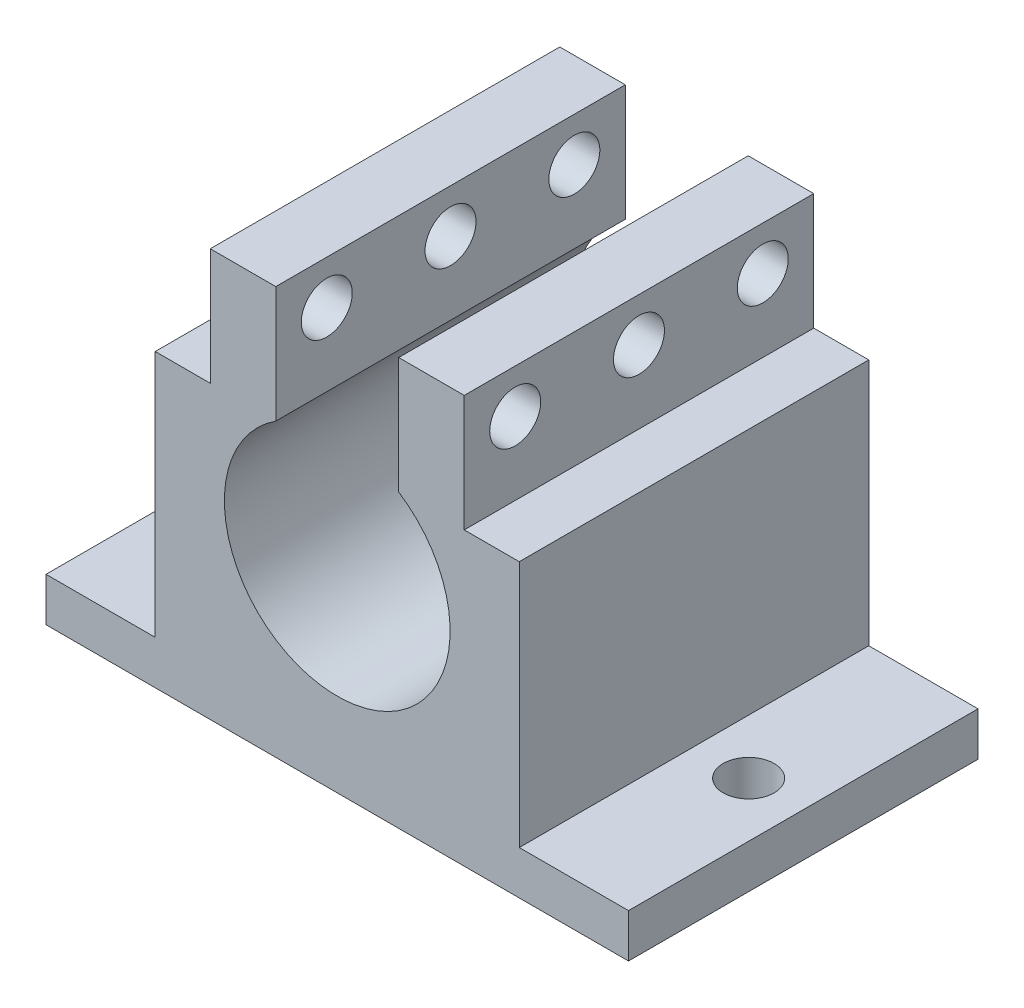
ISO-10303-21;
HEADER;
FILE_DESCRIPTION(('STEP AP214'),'2;1');
FILE_NAME('part.step','',(''),(''),'','','');
FILE_SCHEMA(('AUTOMOTIVE_DESIGN { 1 0 10303 214 1 1 1 1 }'));
ENDSEC;
DATA;
#1=APPLICATION_CONTEXT('core data for automotive mechanical design processes');
#2=APPLICATION_PROTOCOL_DEFINITION('international standard','automotive_design',2000,#1);
#3=PRODUCT_CONTEXT('',#1,'mechanical');
#4=PRODUCT('Part','Part','',(#3));
#5=PRODUCT_RELATED_PRODUCT_CATEGORY('part','',(#4));
#6=PRODUCT_DEFINITION_FORMATION('','',#4);
#7=PRODUCT_DEFINITION_CONTEXT('part definition',#1,'design');
#8=PRODUCT_DEFINITION('design','',#6,#7);
#9=PRODUCT_DEFINITION_SHAPE('','',#8);
#10=(LENGTH_UNIT() NAMED_UNIT(*) SI_UNIT(.MILLI.,.METRE.));
#11=(NAMED_UNIT(*) PLANE_ANGLE_UNIT() SI_UNIT($,.RADIAN.));
#12=(NAMED_UNIT(*) SI_UNIT($,.STERADIAN.) SOLID_ANGLE_UNIT());
#13=UNCERTAINTY_MEASURE_WITH_UNIT(LENGTH_MEASURE(1.E-05),#10,'distance_accuracy_value','');
#14=(GEOMETRIC_REPRESENTATION_CONTEXT(3) GLOBAL_UNCERTAINTY_ASSIGNED_CONTEXT((#13)) GLOBAL_UNIT_ASSIGNED_CONTEXT((#10,
#11,#12)) REPRESENTATION_CONTEXT('',''));
#15=CARTESIAN_POINT('',(0.,0.,0.));
#16=DIRECTION('',(0.,0.,1.));
#17=DIRECTION('',(1.,0.,0.));
#18=AXIS2_PLACEMENT_3D('',#15,#16,#17);
#19=CARTESIAN_POINT('',(-12.5,-10.,24.));
#20=DIRECTION('',(1.,0.,0.));
#21=DIRECTION('',(0.,0.,-1.));
#22=AXIS2_PLACEMENT_3D('',#19,#20,#21);
#23=PLANE('',#22);
#24=DIRECTION('',(0.,0.,-1.));
#25=VECTOR('',#24,1.);
#26=CARTESIAN_POINT('',(-12.5,-7.,32.0777472107018));
#27=LINE('',#26,#25);
#28=CARTESIAN_POINT('',(-12.5,-7.,24.));
#29=VERTEX_POINT('',#28);
#30=CARTESIAN_POINT('',(-12.5,-7.,0.));
#31=VERTEX_POINT('',#30);
#32=EDGE_CURVE('E56',#29,#31,#27,.T.);
#33=ORIENTED_EDGE('',*,*,#32,.F.);
#34=DIRECTION('',(0.,-1.,0.));
#35=VECTOR('',#34,1.);
#36=CARTESIAN_POINT('',(-12.5,-10.,24.));
#37=LINE('',#36,#35);
#38=CARTESIAN_POINT('',(-12.5,10.,24.));
#39=VERTEX_POINT('',#38);
#40=EDGE_CURVE('E243',#39,#29,#37,.T.);
#41=ORIENTED_EDGE('',*,*,#40,.F.);
#42=DIRECTION('',(0.,0.,-1.));
#43=VECTOR('',#42,1.);
#44=CARTESIAN_POINT('',(-12.5,10.,24.));
#45=LINE('',#44,#43);
#46=CARTESIAN_POINT('',(-12.5,10.,0.));
#47=VERTEX_POINT('',#46);
#48=EDGE_CURVE('E256',#39,#47,#45,.T.);
#49=ORIENTED_EDGE('',*,*,#48,.T.);
#50=DIRECTION('',(0.,-1.,0.));
#51=VECTOR('',#50,1.);
#52=CARTESIAN_POINT('',(-12.5,-10.,0.));
#53=LINE('',#52,#51);
#54=EDGE_CURVE('E232',#47,#31,#53,.T.);
#55=ORIENTED_EDGE('',*,*,#54,.T.);
#56=EDGE_LOOP('',(#33,#41,#49,#55));
#57=FACE_BOUND('',#56,.T.);
#58=ADVANCED_FACE('F32',(#57),#23,.F.);
#59=CARTESIAN_POINT('',(12.5,10.,24.));
#60=DIRECTION('',(0.,-1.,0.));
#61=DIRECTION('',(1.,0.,0.));
#62=AXIS2_PLACEMENT_3D('',#59,#60,#61);
#63=PLANE('',#62);
#64=DIRECTION('',(0.,0.,-1.));
#65=VECTOR('',#64,1.);
#66=CARTESIAN_POINT('',(8.72048575403354,10.,33.1787798753429));
#67=LINE('',#66,#65);
#68=CARTESIAN_POINT('',(8.72048575403354,10.,24.));
#69=VERTEX_POINT('',#68);
#70=CARTESIAN_POINT('',(8.72048575403354,10.,0.));
#71=VERTEX_POINT('',#70);
#72=EDGE_CURVE('E201',#69,#71,#67,.T.);
#73=ORIENTED_EDGE('',*,*,#72,.F.);
#74=DIRECTION('',(-1.,0.,0.));
#75=VECTOR('',#74,1.);
#76=CARTESIAN_POINT('',(12.5,10.,24.));
#77=LINE('',#76,#75);
#78=CARTESIAN_POINT('',(12.5,10.,24.));
#79=VERTEX_POINT('',#78);
#80=EDGE_CURVE('E249',#79,#69,#77,.T.);
#81=ORIENTED_EDGE('',*,*,#80,.F.);
#82=DIRECTION('',(0.,0.,-1.));
#83=VECTOR('',#82,1.);
#84=CARTESIAN_POINT('',(12.5,10.,24.));
#85=LINE('',#84,#83);
#86=CARTESIAN_POINT('',(12.5,10.,0.));
#87=VERTEX_POINT('',#86);
#88=EDGE_CURVE('E11',#79,#87,#85,.T.);
#89=ORIENTED_EDGE('',*,*,#88,.T.);
#90=DIRECTION('',(-1.,0.,0.));
#91=VECTOR('',#90,1.);
#92=CARTESIAN_POINT('',(12.5,10.,0.));
#93=LINE('',#92,#91);
#94=EDGE_CURVE('E262',#87,#71,#93,.T.);
#95=ORIENTED_EDGE('',*,*,#94,.T.);
#96=EDGE_LOOP('',(#73,#81,#89,#95));
#97=FACE_BOUND('',#96,.T.);
#98=ADVANCED_FACE('F355',(#97),#63,.F.);
#99=CARTESIAN_POINT('',(-4.22048575403354,10.,24.));
#100=DIRECTION('',(0.,-1.,0.));
#101=DIRECTION('',(1.,0.,0.));
#102=AXIS2_PLACEMENT_3D('',#99,#100,#101);
#103=PLANE('',#102);
#104=DIRECTION('',(0.,0.,-1.));
#105=VECTOR('',#104,1.);
#106=CARTESIAN_POINT('',(-8.72048575403354,10.,33.1787798753429));
#107=LINE('',#106,#105);
#108=CARTESIAN_POINT('',(-8.72048575403354,10.,24.));
#109=VERTEX_POINT('',#108);
#110=CARTESIAN_POINT('',(-8.72048575403354,10.,0.));
#111=VERTEX_POINT('',#110);
#112=EDGE_CURVE('E221',#109,#111,#107,.T.);
#113=ORIENTED_EDGE('',*,*,#112,.T.);
#114=DIRECTION('',(-1.,0.,0.));
#115=VECTOR('',#114,1.);
#116=CARTESIAN_POINT('',(-4.22048575403354,10.,0.));
#117=LINE('',#116,#115);
#118=EDGE_CURVE('E245',#111,#47,#117,.T.);
#119=ORIENTED_EDGE('',*,*,#118,.T.);
#120=ORIENTED_EDGE('',*,*,#48,.F.);
#121=DIRECTION('',(-1.,0.,0.));
#122=VECTOR('',#121,1.);
#123=CARTESIAN_POINT('',(-4.22048575403354,10.,24.));
#124=LINE('',#123,#122);
#125=EDGE_CURVE('E254',#109,#39,#124,.T.);
#126=ORIENTED_EDGE('',*,*,#125,.F.);
#127=EDGE_LOOP('',(#113,#119,#120,#126));
#128=FACE_BOUND('',#127,.T.);
#129=ADVANCED_FACE('F353',(#128),#103,.F.);
#130=CARTESIAN_POINT('',(12.5,-10.,24.));
#131=DIRECTION('',(0.,1.,0.));
#132=DIRECTION('',(-1.,0.,0.));
#133=AXIS2_PLACEMENT_3D('',#130,#131,#132);
#134=PLANE('',#133);
#135=CARTESIAN_POINT('',(16.25,-10.,12.));
#136=DIRECTION('',(0.,1.,0.));
#137=DIRECTION('',(-1.,0.,0.));
#138=AXIS2_PLACEMENT_3D('',#135,#136,#137);
#139=CIRCLE('',#138,1.75);
#140=CARTESIAN_POINT('',(14.5,-10.,12.));
#141=VERTEX_POINT('',#140);
#142=EDGE_CURVE('E287',#141,#141,#139,.F.);
#143=ORIENTED_EDGE('',*,*,#142,.F.);
#144=EDGE_LOOP('',(#143));
#145=FACE_BOUND('',#144,.T.);
#146=CARTESIAN_POINT('',(-16.25,-10.,12.));
#147=DIRECTION('',(0.,1.,0.));
#148=DIRECTION('',(-1.,0.,0.));
#149=AXIS2_PLACEMENT_3D('',#146,#147,#148);
#150=CIRCLE('',#149,1.75);
#151=CARTESIAN_POINT('',(-18.,-10.,12.));
#152=VERTEX_POINT('',#151);
#153=EDGE_CURVE('E276',#152,#152,#150,.F.);
#154=ORIENTED_EDGE('',*,*,#153,.F.);
#155=EDGE_LOOP('',(#154));
#156=FACE_BOUND('',#155,.T.);
#157=DIRECTION('',(1.,0.,0.));
#158=VECTOR('',#157,1.);
#159=CARTESIAN_POINT('',(12.5,-10.,0.));
#160=LINE('',#159,#158);
#161=CARTESIAN_POINT('',(-20.,-10.,0.));
#162=VERTEX_POINT('',#161);
#163=CARTESIAN_POINT('',(20.,-10.,0.));
#164=VERTEX_POINT('',#163);
#165=EDGE_CURVE('E258',#162,#164,#160,.T.);
#166=ORIENTED_EDGE('',*,*,#165,.T.);
#167=DIRECTION('',(0.,0.,-1.));
#168=VECTOR('',#167,1.);
#169=CARTESIAN_POINT('',(20.,-10.,32.0777472107018));
#170=LINE('',#169,#168);
#171=CARTESIAN_POINT('',(20.,-10.,24.));
#172=VERTEX_POINT('',#171);
#173=EDGE_CURVE('E173',#172,#164,#170,.T.);
#174=ORIENTED_EDGE('',*,*,#173,.F.);
#175=DIRECTION('',(1.,0.,0.));
#176=VECTOR('',#175,1.);
#177=CARTESIAN_POINT('',(12.5,-10.,24.));
#178=LINE('',#177,#176);
#179=CARTESIAN_POINT('',(-20.,-10.,24.));
#180=VERTEX_POINT('',#179);
#181=EDGE_CURVE('E166',#180,#172,#178,.T.);
#182=ORIENTED_EDGE('',*,*,#181,.F.);
#183=DIRECTION('',(0.,0.,-1.));
#184=VECTOR('',#183,1.);
#185=CARTESIAN_POINT('',(-20.,-10.,32.0777472107018));
#186=LINE('',#185,#184);
#187=EDGE_CURVE('E180',#180,#162,#186,.T.);
#188=ORIENTED_EDGE('',*,*,#187,.T.);
#189=EDGE_LOOP('',(#166,#174,#182,#188));
#190=FACE_BOUND('',#189,.T.);
#191=ADVANCED_FACE('F364',(#145,#156,#190),#134,.F.);
#192=CARTESIAN_POINT('',(12.5,-10.,24.));
#193=DIRECTION('',(-1.,0.,0.));
#194=DIRECTION('',(0.,0.,1.));
#195=AXIS2_PLACEMENT_3D('',#192,#193,#194);
#196=PLANE('',#195);
#197=DIRECTION('',(0.,1.,0.));
#198=VECTOR('',#197,1.);
#199=CARTESIAN_POINT('',(12.5,-10.,24.));
#200=LINE('',#199,#198);
#201=CARTESIAN_POINT('',(12.5,-7.,24.));
#202=VERTEX_POINT('',#201);
#203=EDGE_CURVE('E247',#202,#79,#200,.T.);
#204=ORIENTED_EDGE('',*,*,#203,.F.);
#205=DIRECTION('',(0.,0.,-1.));
#206=VECTOR('',#205,1.);
#207=CARTESIAN_POINT('',(12.5,-7.,32.0777472107018));
#208=LINE('',#207,#206);
#209=CARTESIAN_POINT('',(12.5,-7.,0.));
#210=VERTEX_POINT('',#209);
#211=EDGE_CURVE('E160',#202,#210,#208,.T.);
#212=ORIENTED_EDGE('',*,*,#211,.T.);
#213=DIRECTION('',(0.,1.,0.));
#214=VECTOR('',#213,1.);
#215=CARTESIAN_POINT('',(12.5,-10.,0.));
#216=LINE('',#215,#214);
#217=EDGE_CURVE('E260',#210,#87,#216,.T.);
#218=ORIENTED_EDGE('',*,*,#217,.T.);
#219=ORIENTED_EDGE('',*,*,#88,.F.);
#220=EDGE_LOOP('',(#204,#212,#218,#219));
#221=FACE_BOUND('',#220,.T.);
#222=ADVANCED_FACE('F368',(#221),#196,.F.);
#223=CARTESIAN_POINT('',(0.,3.5,24.));
#224=DIRECTION('',(0.,0.,-1.));
#225=DIRECTION('',(-1.,0.,0.));
#226=AXIS2_PLACEMENT_3D('',#223,#224,#225);
#227=CYLINDRICAL_SURFACE('',#226,7.75);
#228=CARTESIAN_POINT('',(0.,3.5,0.));
#229=DIRECTION('',(0.,0.,-1.));
#230=DIRECTION('',(1.,0.,0.));
#231=AXIS2_PLACEMENT_3D('',#228,#229,#230);
#232=CIRCLE('',#231,7.75);
#233=CARTESIAN_POINT('',(4.22048575403354,10.,0.));
#234=VERTEX_POINT('',#233);
#235=CARTESIAN_POINT('',(-4.22048575403354,10.,0.));
#236=VERTEX_POINT('',#235);
#237=EDGE_CURVE('E264',#234,#236,#232,.T.);
#238=ORIENTED_EDGE('',*,*,#237,.T.);
#239=DIRECTION('',(0.,0.,-1.));
#240=VECTOR('',#239,1.);
#241=CARTESIAN_POINT('',(-4.22048575403354,10.,24.));
#242=LINE('',#241,#240);
#243=CARTESIAN_POINT('',(-4.22048575403354,10.,24.));
#244=VERTEX_POINT('',#243);
#245=EDGE_CURVE('E269',#244,#236,#242,.T.);
#246=ORIENTED_EDGE('',*,*,#245,.F.);
#247=CARTESIAN_POINT('',(0.,3.5,24.));
#248=DIRECTION('',(0.,0.,-1.));
#249=DIRECTION('',(1.,0.,0.));
#250=AXIS2_PLACEMENT_3D('',#247,#248,#249);
#251=CIRCLE('',#250,7.75);
#252=CARTESIAN_POINT('',(4.22048575403354,10.,24.));
#253=VERTEX_POINT('',#252);
#254=EDGE_CURVE('E252',#253,#244,#251,.T.);
#255=ORIENTED_EDGE('',*,*,#254,.F.);
#256=DIRECTION('',(0.,0.,-1.));
#257=VECTOR('',#256,1.);
#258=CARTESIAN_POINT('',(4.22048575403354,10.,24.));
#259=LINE('',#258,#257);
#260=EDGE_CURVE('E40',#253,#234,#259,.T.);
#261=ORIENTED_EDGE('',*,*,#260,.T.);
#262=EDGE_LOOP('',(#238,#246,#255,#261));
#263=FACE_BOUND('',#262,.T.);
#264=ADVANCED_FACE('F338',(#263),#227,.F.);
#265=CARTESIAN_POINT('',(0.,3.5,24.));
#266=DIRECTION('',(0.,0.,1.));
#267=DIRECTION('',(1.,0.,0.));
#268=AXIS2_PLACEMENT_3D('',#265,#266,#267);
#269=PLANE('',#268);
#270=ORIENTED_EDGE('',*,*,#40,.T.);
#271=DIRECTION('',(-1.,0.,0.));
#272=VECTOR('',#271,1.);
#273=CARTESIAN_POINT('',(-12.5,-7.,24.));
#274=LINE('',#273,#272);
#275=CARTESIAN_POINT('',(-20.,-7.00000000000001,24.));
#276=VERTEX_POINT('',#275);
#277=EDGE_CURVE('E187',#29,#276,#274,.T.);
#278=ORIENTED_EDGE('',*,*,#277,.T.);
#279=DIRECTION('',(0.,-1.,0.));
#280=VECTOR('',#279,1.);
#281=CARTESIAN_POINT('',(-20.,-10.,24.));
#282=LINE('',#281,#280);
#283=EDGE_CURVE('E184',#276,#180,#282,.T.);
#284=ORIENTED_EDGE('',*,*,#283,.T.);
#285=ORIENTED_EDGE('',*,*,#181,.T.);
#286=DIRECTION('',(0.,1.,0.));
#287=VECTOR('',#286,1.);
#288=CARTESIAN_POINT('',(20.,-10.,24.));
#289=LINE('',#288,#287);
#290=CARTESIAN_POINT('',(20.,-7.,24.));
#291=VERTEX_POINT('',#290);
#292=EDGE_CURVE('E152',#172,#291,#289,.T.);
#293=ORIENTED_EDGE('',*,*,#292,.T.);
#294=DIRECTION('',(-1.,0.,0.));
#295=VECTOR('',#294,1.);
#296=CARTESIAN_POINT('',(12.5,-7.,24.));
#297=LINE('',#296,#295);
#298=EDGE_CURVE('E158',#291,#202,#297,.T.);
#299=ORIENTED_EDGE('',*,*,#298,.T.);
#300=ORIENTED_EDGE('',*,*,#203,.T.);
#301=ORIENTED_EDGE('',*,*,#80,.T.);
#302=DIRECTION('',(0.,1.,0.));
#303=VECTOR('',#302,1.);
#304=CARTESIAN_POINT('',(8.72048575403354,10.,24.));
#305=LINE('',#304,#303);
#306=CARTESIAN_POINT('',(8.72048575403354,18.,24.));
#307=VERTEX_POINT('',#306);
#308=EDGE_CURVE('E205',#69,#307,#305,.T.);
#309=ORIENTED_EDGE('',*,*,#308,.T.);
#310=DIRECTION('',(-1.,0.,0.));
#311=VECTOR('',#310,1.);
#312=CARTESIAN_POINT('',(4.22048575403354,18.,24.));
#313=LINE('',#312,#311);
#314=CARTESIAN_POINT('',(4.22048575403354,18.,24.));
#315=VERTEX_POINT('',#314);
#316=EDGE_CURVE('E196',#307,#315,#313,.T.);
#317=ORIENTED_EDGE('',*,*,#316,.T.);
#318=DIRECTION('',(0.,-1.,0.));
#319=VECTOR('',#318,1.);
#320=CARTESIAN_POINT('',(4.22048575403354,10.,24.));
#321=LINE('',#320,#319);
#322=EDGE_CURVE('E209',#315,#253,#321,.T.);
#323=ORIENTED_EDGE('',*,*,#322,.T.);
#324=ORIENTED_EDGE('',*,*,#254,.T.);
#325=DIRECTION('',(0.,1.,0.));
#326=VECTOR('',#325,1.);
#327=CARTESIAN_POINT('',(-4.22048575403354,10.,24.));
#328=LINE('',#327,#326);
#329=CARTESIAN_POINT('',(-4.22048575403354,18.,24.));
#330=VERTEX_POINT('',#329);
#331=EDGE_CURVE('E236',#244,#330,#328,.T.);
#332=ORIENTED_EDGE('',*,*,#331,.T.);
#333=DIRECTION('',(-1.,0.,0.));
#334=VECTOR('',#333,1.);
#335=CARTESIAN_POINT('',(-4.22048575403354,18.,24.));
#336=LINE('',#335,#334);
#337=CARTESIAN_POINT('',(-8.72048575403354,18.,24.));
#338=VERTEX_POINT('',#337);
#339=EDGE_CURVE('E233',#330,#338,#336,.T.);
#340=ORIENTED_EDGE('',*,*,#339,.T.);
#341=DIRECTION('',(0.,-1.,0.));
#342=VECTOR('',#341,1.);
#343=CARTESIAN_POINT('',(-8.72048575403354,10.,24.));
#344=LINE('',#343,#342);
#345=EDGE_CURVE('E229',#338,#109,#344,.T.);
#346=ORIENTED_EDGE('',*,*,#345,.T.);
#347=ORIENTED_EDGE('',*,*,#125,.T.);
#348=EDGE_LOOP('',(#270,#278,#284,#285,#293,#299,#300,#301,#309,#317,#323,#324,#332,#340,#346,#347));
#349=FACE_BOUND('',#348,.T.);
#350=ADVANCED_FACE('F164',(#349),#269,.T.);
#351=CARTESIAN_POINT('',(0.,3.5,0.));
#352=DIRECTION('',(0.,0.,1.));
#353=DIRECTION('',(1.,0.,0.));
#354=AXIS2_PLACEMENT_3D('',#351,#352,#353);
#355=PLANE('',#354);
#356=ORIENTED_EDGE('',*,*,#54,.F.);
#357=ORIENTED_EDGE('',*,*,#118,.F.);
#358=DIRECTION('',(0.,-1.,0.));
#359=VECTOR('',#358,1.);
#360=CARTESIAN_POINT('',(-8.72048575403354,10.,0.));
#361=LINE('',#360,#359);
#362=CARTESIAN_POINT('',(-8.72048575403354,18.,0.));
#363=VERTEX_POINT('',#362);
#364=EDGE_CURVE('E218',#363,#111,#361,.T.);
#365=ORIENTED_EDGE('',*,*,#364,.F.);
#366=DIRECTION('',(-1.,0.,0.));
#367=VECTOR('',#366,1.);
#368=CARTESIAN_POINT('',(-4.22048575403354,18.,0.));
#369=LINE('',#368,#367);
#370=CARTESIAN_POINT('',(-4.22048575403354,18.,0.));
#371=VERTEX_POINT('',#370);
#372=EDGE_CURVE('E223',#371,#363,#369,.T.);
#373=ORIENTED_EDGE('',*,*,#372,.F.);
#374=DIRECTION('',(0.,1.,0.));
#375=VECTOR('',#374,1.);
#376=CARTESIAN_POINT('',(-4.22048575403354,10.,0.));
#377=LINE('',#376,#375);
#378=EDGE_CURVE('E208',#236,#371,#377,.T.);
#379=ORIENTED_EDGE('',*,*,#378,.F.);
#380=ORIENTED_EDGE('',*,*,#237,.F.);
#381=DIRECTION('',(0.,-1.,0.));
#382=VECTOR('',#381,1.);
#383=CARTESIAN_POINT('',(4.22048575403354,10.,0.));
#384=LINE('',#383,#382);
#385=CARTESIAN_POINT('',(4.22048575403354,18.,0.));
#386=VERTEX_POINT('',#385);
#387=EDGE_CURVE('E202',#386,#234,#384,.T.);
#388=ORIENTED_EDGE('',*,*,#387,.F.);
#389=DIRECTION('',(-1.,0.,0.));
#390=VECTOR('',#389,1.);
#391=CARTESIAN_POINT('',(4.22048575403354,18.,0.));
#392=LINE('',#391,#390);
#393=CARTESIAN_POINT('',(8.72048575403354,18.,0.));
#394=VERTEX_POINT('',#393);
#395=EDGE_CURVE('E193',#394,#386,#392,.T.);
#396=ORIENTED_EDGE('',*,*,#395,.F.);
#397=DIRECTION('',(0.,1.,0.));
#398=VECTOR('',#397,1.);
#399=CARTESIAN_POINT('',(8.72048575403354,10.,0.));
#400=LINE('',#399,#398);
#401=EDGE_CURVE('E198',#71,#394,#400,.T.);
#402=ORIENTED_EDGE('',*,*,#401,.F.);
#403=ORIENTED_EDGE('',*,*,#94,.F.);
#404=ORIENTED_EDGE('',*,*,#217,.F.);
#405=DIRECTION('',(-1.,0.,0.));
#406=VECTOR('',#405,1.);
#407=CARTESIAN_POINT('',(12.5,-7.,0.));
#408=LINE('',#407,#406);
#409=CARTESIAN_POINT('',(20.,-7.,0.));
#410=VERTEX_POINT('',#409);
#411=EDGE_CURVE('E48',#410,#210,#408,.T.);
#412=ORIENTED_EDGE('',*,*,#411,.F.);
#413=DIRECTION('',(0.,1.,0.));
#414=VECTOR('',#413,1.);
#415=CARTESIAN_POINT('',(20.,-10.,0.));
#416=LINE('',#415,#414);
#417=EDGE_CURVE('E155',#164,#410,#416,.T.);
#418=ORIENTED_EDGE('',*,*,#417,.F.);
#419=ORIENTED_EDGE('',*,*,#165,.F.);
#420=DIRECTION('',(0.,-1.,0.));
#421=VECTOR('',#420,1.);
#422=CARTESIAN_POINT('',(-20.,-10.,0.));
#423=LINE('',#422,#421);
#424=CARTESIAN_POINT('',(-20.,-7.00000000000001,0.));
#425=VERTEX_POINT('',#424);
#426=EDGE_CURVE('E177',#425,#162,#423,.T.);
#427=ORIENTED_EDGE('',*,*,#426,.F.);
#428=DIRECTION('',(-1.,0.,0.));
#429=VECTOR('',#428,1.);
#430=CARTESIAN_POINT('',(-12.5,-7.,0.));
#431=LINE('',#430,#429);
#432=EDGE_CURVE('E168',#31,#425,#431,.T.);
#433=ORIENTED_EDGE('',*,*,#432,.F.);
#434=EDGE_LOOP('',(#356,#357,#365,#373,#379,#380,#388,#396,#402,#403,#404,#412,#418,#419,#427,#433));
#435=FACE_BOUND('',#434,.T.);
#436=ADVANCED_FACE('F328',(#435),#355,.F.);
#437=CARTESIAN_POINT('',(-4.22048575403354,10.,33.1787798753429));
#438=DIRECTION('',(-1.,0.,0.));
#439=DIRECTION('',(0.,0.,1.));
#440=AXIS2_PLACEMENT_3D('',#437,#438,#439);
#441=PLANE('',#440);
#442=CARTESIAN_POINT('',(-4.22048575403354,15.,12.));
#443=DIRECTION('',(-1.,0.,0.));
#444=DIRECTION('',(0.,0.,1.));
#445=AXIS2_PLACEMENT_3D('',#442,#443,#444);
#446=CIRCLE('',#445,1.75);
#447=CARTESIAN_POINT('',(-4.22048575403354,15.,13.75));
#448=VERTEX_POINT('',#447);
#449=EDGE_CURVE('E307',#448,#448,#446,.F.);
#450=ORIENTED_EDGE('',*,*,#449,.F.);
#451=EDGE_LOOP('',(#450));
#452=FACE_BOUND('',#451,.T.);
#453=CARTESIAN_POINT('',(-4.22048575403354,15.,3.5));
#454=DIRECTION('',(-1.,0.,0.));
#455=DIRECTION('',(0.,0.,1.));
#456=AXIS2_PLACEMENT_3D('',#453,#454,#455);
#457=CIRCLE('',#456,1.75);
#458=CARTESIAN_POINT('',(-4.22048575403354,15.,5.25));
#459=VERTEX_POINT('',#458);
#460=EDGE_CURVE('E301',#459,#459,#457,.F.);
#461=ORIENTED_EDGE('',*,*,#460,.F.);
#462=EDGE_LOOP('',(#461));
#463=FACE_BOUND('',#462,.T.);
#464=CARTESIAN_POINT('',(-4.22048575403354,15.,20.5));
#465=DIRECTION('',(-1.,0.,0.));
#466=DIRECTION('',(0.,0.,1.));
#467=AXIS2_PLACEMENT_3D('',#464,#465,#466);
#468=CIRCLE('',#467,1.75);
#469=CARTESIAN_POINT('',(-4.22048575403354,15.,22.25));
#470=VERTEX_POINT('',#469);
#471=EDGE_CURVE('E176',#470,#470,#468,.F.);
#472=ORIENTED_EDGE('',*,*,#471,.F.);
#473=EDGE_LOOP('',(#472));
#474=FACE_BOUND('',#473,.T.);
#475=ORIENTED_EDGE('',*,*,#331,.F.);
#476=ORIENTED_EDGE('',*,*,#245,.T.);
#477=ORIENTED_EDGE('',*,*,#378,.T.);
#478=DIRECTION('',(0.,0.,-1.));
#479=VECTOR('',#478,1.);
#480=CARTESIAN_POINT('',(-4.22048575403354,18.,33.1787798753429));
#481=LINE('',#480,#479);
#482=EDGE_CURVE('E226',#330,#371,#481,.T.);
#483=ORIENTED_EDGE('',*,*,#482,.F.);
#484=EDGE_LOOP('',(#475,#476,#477,#483));
#485=FACE_BOUND('',#484,.T.);
#486=ADVANCED_FACE('F324',(#452,#463,#474,#485),#441,.F.);
#487=CARTESIAN_POINT('',(-4.22048575403354,18.,33.1787798753429));
#488=DIRECTION('',(0.,-1.,0.));
#489=DIRECTION('',(0.,0.,-1.));
#490=AXIS2_PLACEMENT_3D('',#487,#488,#489);
#491=PLANE('',#490);
#492=ORIENTED_EDGE('',*,*,#339,.F.);
#493=ORIENTED_EDGE('',*,*,#482,.T.);
#494=ORIENTED_EDGE('',*,*,#372,.T.);
#495=DIRECTION('',(0.,0.,-1.));
#496=VECTOR('',#495,1.);
#497=CARTESIAN_POINT('',(-8.72048575403354,18.,33.1787798753429));
#498=LINE('',#497,#496);
#499=EDGE_CURVE('E222',#338,#363,#498,.T.);
#500=ORIENTED_EDGE('',*,*,#499,.F.);
#501=EDGE_LOOP('',(#492,#493,#494,#500));
#502=FACE_BOUND('',#501,.T.);
#503=ADVANCED_FACE('F327',(#502),#491,.F.);
#504=CARTESIAN_POINT('',(-8.72048575403354,10.,33.1787798753429));
#505=DIRECTION('',(1.,0.,0.));
#506=DIRECTION('',(0.,0.,-1.));
#507=AXIS2_PLACEMENT_3D('',#504,#505,#506);
#508=PLANE('',#507);
#509=CARTESIAN_POINT('',(-8.72048575403354,15.,12.));
#510=DIRECTION('',(1.,0.,0.));
#511=DIRECTION('',(0.,0.,-1.));
#512=AXIS2_PLACEMENT_3D('',#509,#510,#511);
#513=CIRCLE('',#512,1.75);
#514=CARTESIAN_POINT('',(-8.72048575403354,15.,10.25));
#515=VERTEX_POINT('',#514);
#516=EDGE_CURVE('E290',#515,#515,#513,.T.);
#517=ORIENTED_EDGE('',*,*,#516,.T.);
#518=EDGE_LOOP('',(#517));
#519=FACE_BOUND('',#518,.T.);
#520=CARTESIAN_POINT('',(-8.72048575403354,15.,3.5));
#521=DIRECTION('',(1.,0.,0.));
#522=DIRECTION('',(0.,0.,-1.));
#523=AXIS2_PLACEMENT_3D('',#520,#521,#522);
#524=CIRCLE('',#523,1.75);
#525=CARTESIAN_POINT('',(-8.72048575403354,15.,1.75));
#526=VERTEX_POINT('',#525);
#527=EDGE_CURVE('E275',#526,#526,#524,.T.);
#528=ORIENTED_EDGE('',*,*,#527,.T.);
#529=EDGE_LOOP('',(#528));
#530=FACE_BOUND('',#529,.T.);
#531=CARTESIAN_POINT('',(-8.72048575403354,15.,20.5));
#532=DIRECTION('',(1.,0.,0.));
#533=DIRECTION('',(0.,0.,-1.));
#534=AXIS2_PLACEMENT_3D('',#531,#532,#533);
#535=CIRCLE('',#534,1.75);
#536=CARTESIAN_POINT('',(-8.72048575403354,15.,18.75));
#537=VERTEX_POINT('',#536);
#538=EDGE_CURVE('E310',#537,#537,#535,.T.);
#539=ORIENTED_EDGE('',*,*,#538,.T.);
#540=EDGE_LOOP('',(#539));
#541=FACE_BOUND('',#540,.T.);
#542=ORIENTED_EDGE('',*,*,#345,.F.);
#543=ORIENTED_EDGE('',*,*,#499,.T.);
#544=ORIENTED_EDGE('',*,*,#364,.T.);
#545=ORIENTED_EDGE('',*,*,#112,.F.);
#546=EDGE_LOOP('',(#542,#543,#544,#545));
#547=FACE_BOUND('',#546,.T.);
#548=ADVANCED_FACE('F348',(#519,#530,#541,#547),#508,.F.);
#549=CARTESIAN_POINT('',(4.22048575403354,10.,33.1787798753429));
#550=DIRECTION('',(1.,0.,0.));
#551=DIRECTION('',(0.,0.,-1.));
#552=AXIS2_PLACEMENT_3D('',#549,#550,#551);
#553=PLANE('',#552);
#554=CARTESIAN_POINT('',(4.22048575403354,15.,12.));
#555=DIRECTION('',(1.,0.,0.));
#556=DIRECTION('',(0.,0.,-1.));
#557=AXIS2_PLACEMENT_3D('',#554,#555,#556);
#558=CIRCLE('',#557,1.75);
#559=CARTESIAN_POINT('',(4.22048575403354,15.,10.25));
#560=VERTEX_POINT('',#559);
#561=EDGE_CURVE('E304',#560,#560,#558,.F.);
#562=ORIENTED_EDGE('',*,*,#561,.F.);
#563=EDGE_LOOP('',(#562));
#564=FACE_BOUND('',#563,.T.);
#565=CARTESIAN_POINT('',(4.22048575403354,15.,3.5));
#566=DIRECTION('',(1.,0.,0.));
#567=DIRECTION('',(0.,0.,-1.));
#568=AXIS2_PLACEMENT_3D('',#565,#566,#567);
#569=CIRCLE('',#568,1.75);
#570=CARTESIAN_POINT('',(4.22048575403354,15.,1.75));
#571=VERTEX_POINT('',#570);
#572=EDGE_CURVE('E295',#571,#571,#569,.F.);
#573=ORIENTED_EDGE('',*,*,#572,.F.);
#574=EDGE_LOOP('',(#573));
#575=FACE_BOUND('',#574,.T.);
#576=CARTESIAN_POINT('',(4.22048575403354,15.,20.5));
#577=DIRECTION('',(1.,0.,0.));
#578=DIRECTION('',(0.,0.,-1.));
#579=AXIS2_PLACEMENT_3D('',#576,#577,#578);
#580=CIRCLE('',#579,1.75);
#581=CARTESIAN_POINT('',(4.22048575403354,15.,18.75));
#582=VERTEX_POINT('',#581);
#583=EDGE_CURVE('E316',#582,#582,#580,.F.);
#584=ORIENTED_EDGE('',*,*,#583,.F.);
#585=EDGE_LOOP('',(#584));
#586=FACE_BOUND('',#585,.T.);
#587=ORIENTED_EDGE('',*,*,#322,.F.);
#588=DIRECTION('',(0.,0.,-1.));
#589=VECTOR('',#588,1.);
#590=CARTESIAN_POINT('',(4.22048575403354,18.,33.1787798753429));
#591=LINE('',#590,#589);
#592=EDGE_CURVE('E186',#315,#386,#591,.T.);
#593=ORIENTED_EDGE('',*,*,#592,.T.);
#594=ORIENTED_EDGE('',*,*,#387,.T.);
#595=ORIENTED_EDGE('',*,*,#260,.F.);
#596=EDGE_LOOP('',(#587,#593,#594,#595));
#597=FACE_BOUND('',#596,.T.);
#598=ADVANCED_FACE('F393',(#564,#575,#586,#597),#553,.F.);
#599=CARTESIAN_POINT('',(8.72048575403354,10.,33.1787798753429));
#600=DIRECTION('',(-1.,0.,0.));
#601=DIRECTION('',(0.,0.,1.));
#602=AXIS2_PLACEMENT_3D('',#599,#600,#601);
#603=PLANE('',#602);
#604=CARTESIAN_POINT('',(8.72048575403354,15.,12.));
#605=DIRECTION('',(-1.,0.,0.));
#606=DIRECTION('',(0.,0.,1.));
#607=AXIS2_PLACEMENT_3D('',#604,#605,#606);
#608=CIRCLE('',#607,1.75);
#609=CARTESIAN_POINT('',(8.72048575403354,15.,13.75));
#610=VERTEX_POINT('',#609);
#611=EDGE_CURVE('E293',#610,#610,#608,.T.);
#612=ORIENTED_EDGE('',*,*,#611,.T.);
#613=EDGE_LOOP('',(#612));
#614=FACE_BOUND('',#613,.T.);
#615=CARTESIAN_POINT('',(8.72048575403354,15.,3.5));
#616=DIRECTION('',(-1.,0.,0.));
#617=DIRECTION('',(0.,0.,1.));
#618=AXIS2_PLACEMENT_3D('',#615,#616,#617);
#619=CIRCLE('',#618,1.75);
#620=CARTESIAN_POINT('',(8.72048575403354,15.,5.25));
#621=VERTEX_POINT('',#620);
#622=EDGE_CURVE('E280',#621,#621,#619,.T.);
#623=ORIENTED_EDGE('',*,*,#622,.T.);
#624=EDGE_LOOP('',(#623));
#625=FACE_BOUND('',#624,.T.);
#626=CARTESIAN_POINT('',(8.72048575403354,15.,20.5));
#627=DIRECTION('',(-1.,0.,0.));
#628=DIRECTION('',(0.,0.,1.));
#629=AXIS2_PLACEMENT_3D('',#626,#627,#628);
#630=CIRCLE('',#629,1.75);
#631=CARTESIAN_POINT('',(8.72048575403354,15.,22.25));
#632=VERTEX_POINT('',#631);
#633=EDGE_CURVE('E313',#632,#632,#630,.T.);
#634=ORIENTED_EDGE('',*,*,#633,.T.);
#635=EDGE_LOOP('',(#634));
#636=FACE_BOUND('',#635,.T.);
#637=ORIENTED_EDGE('',*,*,#308,.F.);
#638=ORIENTED_EDGE('',*,*,#72,.T.);
#639=ORIENTED_EDGE('',*,*,#401,.T.);
#640=DIRECTION('',(0.,0.,-1.));
#641=VECTOR('',#640,1.);
#642=CARTESIAN_POINT('',(8.72048575403354,18.,33.1787798753429));
#643=LINE('',#642,#641);
#644=EDGE_CURVE('E197',#307,#394,#643,.T.);
#645=ORIENTED_EDGE('',*,*,#644,.F.);
#646=EDGE_LOOP('',(#637,#638,#639,#645));
#647=FACE_BOUND('',#646,.T.);
#648=ADVANCED_FACE('F388',(#614,#625,#636,#647),#603,.F.);
#649=CARTESIAN_POINT('',(4.22048575403354,18.,33.1787798753429));
#650=DIRECTION('',(0.,-1.,0.));
#651=DIRECTION('',(0.,0.,-1.));
#652=AXIS2_PLACEMENT_3D('',#649,#650,#651);
#653=PLANE('',#652);
#654=ORIENTED_EDGE('',*,*,#316,.F.);
#655=ORIENTED_EDGE('',*,*,#644,.T.);
#656=ORIENTED_EDGE('',*,*,#395,.T.);
#657=ORIENTED_EDGE('',*,*,#592,.F.);
#658=EDGE_LOOP('',(#654,#655,#656,#657));
#659=FACE_BOUND('',#658,.T.);
#660=ADVANCED_FACE('F391',(#659),#653,.F.);
#661=CARTESIAN_POINT('',(-12.5,-7.,32.0777472107018));
#662=DIRECTION('',(0.,-1.,0.));
#663=DIRECTION('',(1.,0.,0.));
#664=AXIS2_PLACEMENT_3D('',#661,#662,#663);
#665=PLANE('',#664);
#666=CARTESIAN_POINT('',(-16.25,-7.,12.));
#667=DIRECTION('',(0.,-1.,0.));
#668=DIRECTION('',(1.,0.,0.));
#669=AXIS2_PLACEMENT_3D('',#666,#667,#668);
#670=CIRCLE('',#669,1.75);
#671=CARTESIAN_POINT('',(-14.5,-7.,12.));
#672=VERTEX_POINT('',#671);
#673=EDGE_CURVE('E273',#672,#672,#670,.T.);
#674=ORIENTED_EDGE('',*,*,#673,.T.);
#675=EDGE_LOOP('',(#674));
#676=FACE_BOUND('',#675,.T.);
#677=ORIENTED_EDGE('',*,*,#277,.F.);
#678=ORIENTED_EDGE('',*,*,#32,.T.);
#679=ORIENTED_EDGE('',*,*,#432,.T.);
#680=DIRECTION('',(0.,0.,-1.));
#681=VECTOR('',#680,1.);
#682=CARTESIAN_POINT('',(-20.,-7.00000000000001,32.0777472107018));
#683=LINE('',#682,#681);
#684=EDGE_CURVE('E181',#276,#425,#683,.T.);
#685=ORIENTED_EDGE('',*,*,#684,.F.);
#686=EDGE_LOOP('',(#677,#678,#679,#685));
#687=FACE_BOUND('',#686,.T.);
#688=ADVANCED_FACE('F519',(#676,#687),#665,.F.);
#689=CARTESIAN_POINT('',(-20.,-10.,32.0777472107018));
#690=DIRECTION('',(1.,0.,0.));
#691=DIRECTION('',(0.,0.,-1.));
#692=AXIS2_PLACEMENT_3D('',#689,#690,#691);
#693=PLANE('',#692);
#694=ORIENTED_EDGE('',*,*,#283,.F.);
#695=ORIENTED_EDGE('',*,*,#684,.T.);
#696=ORIENTED_EDGE('',*,*,#426,.T.);
#697=ORIENTED_EDGE('',*,*,#187,.F.);
#698=EDGE_LOOP('',(#694,#695,#696,#697));
#699=FACE_BOUND('',#698,.T.);
#700=ADVANCED_FACE('F524',(#699),#693,.F.);
#701=CARTESIAN_POINT('',(20.,-10.,32.0777472107018));
#702=DIRECTION('',(-1.,0.,0.));
#703=DIRECTION('',(0.,0.,1.));
#704=AXIS2_PLACEMENT_3D('',#701,#702,#703);
#705=PLANE('',#704);
#706=ORIENTED_EDGE('',*,*,#292,.F.);
#707=ORIENTED_EDGE('',*,*,#173,.T.);
#708=ORIENTED_EDGE('',*,*,#417,.T.);
#709=DIRECTION('',(0.,0.,-1.));
#710=VECTOR('',#709,1.);
#711=CARTESIAN_POINT('',(20.,-7.,32.0777472107018));
#712=LINE('',#711,#710);
#713=EDGE_CURVE('E147',#291,#410,#712,.T.);
#714=ORIENTED_EDGE('',*,*,#713,.F.);
#715=EDGE_LOOP('',(#706,#707,#708,#714));
#716=FACE_BOUND('',#715,.T.);
#717=ADVANCED_FACE('F149',(#716),#705,.F.);
#718=CARTESIAN_POINT('',(12.5,-7.,32.0777472107018));
#719=DIRECTION('',(0.,-1.,0.));
#720=DIRECTION('',(0.,0.,-1.));
#721=AXIS2_PLACEMENT_3D('',#718,#719,#720);
#722=PLANE('',#721);
#723=CARTESIAN_POINT('',(16.25,-7.,12.));
#724=DIRECTION('',(0.,-1.,0.));
#725=DIRECTION('',(0.,0.,-1.));
#726=AXIS2_PLACEMENT_3D('',#723,#724,#725);
#727=CIRCLE('',#726,1.75);
#728=CARTESIAN_POINT('',(16.25,-7.,10.25));
#729=VERTEX_POINT('',#728);
#730=EDGE_CURVE('E35',#729,#729,#727,.T.);
#731=ORIENTED_EDGE('',*,*,#730,.T.);
#732=EDGE_LOOP('',(#731));
#733=FACE_BOUND('',#732,.T.);
#734=ORIENTED_EDGE('',*,*,#298,.F.);
#735=ORIENTED_EDGE('',*,*,#713,.T.);
#736=ORIENTED_EDGE('',*,*,#411,.T.);
#737=ORIENTED_EDGE('',*,*,#211,.F.);
#738=EDGE_LOOP('',(#734,#735,#736,#737));
#739=FACE_BOUND('',#738,.T.);
#740=ADVANCED_FACE('F159',(#733,#739),#722,.F.);
#741=CARTESIAN_POINT('',(13.6702332223394,15.,20.5));
#742=DIRECTION('',(-1.,0.,0.));
#743=DIRECTION('',(0.,0.,1.));
#744=AXIS2_PLACEMENT_3D('',#741,#742,#743);
#745=CYLINDRICAL_SURFACE('',#744,1.75);
#746=ORIENTED_EDGE('',*,*,#633,.F.);
#747=EDGE_LOOP('',(#746));
#748=FACE_BOUND('',#747,.T.);
#749=ORIENTED_EDGE('',*,*,#583,.T.);
#750=EDGE_LOOP('',(#749));
#751=FACE_BOUND('',#750,.T.);
#752=ADVANCED_FACE('F452',(#748,#751),#745,.F.);
#753=ORIENTED_EDGE('',*,*,#538,.F.);
#754=EDGE_LOOP('',(#753));
#755=FACE_BOUND('',#754,.T.);
#756=ORIENTED_EDGE('',*,*,#471,.T.);
#757=EDGE_LOOP('',(#756));
#758=FACE_BOUND('',#757,.T.);
#759=ADVANCED_FACE('F322',(#755,#758),#745,.F.);
#760=CARTESIAN_POINT('',(13.6702332223394,15.,3.5));
#761=DIRECTION('',(-1.,0.,0.));
#762=DIRECTION('',(0.,0.,1.));
#763=AXIS2_PLACEMENT_3D('',#760,#761,#762);
#764=CYLINDRICAL_SURFACE('',#763,1.75);
#765=ORIENTED_EDGE('',*,*,#622,.F.);
#766=EDGE_LOOP('',(#765));
#767=FACE_BOUND('',#766,.T.);
#768=ORIENTED_EDGE('',*,*,#572,.T.);
#769=EDGE_LOOP('',(#768));
#770=FACE_BOUND('',#769,.T.);
#771=ADVANCED_FACE('F468',(#767,#770),#764,.F.);
#772=CARTESIAN_POINT('',(13.6702332223394,15.,12.));
#773=DIRECTION('',(-1.,0.,0.));
#774=DIRECTION('',(0.,0.,1.));
#775=AXIS2_PLACEMENT_3D('',#772,#773,#774);
#776=CYLINDRICAL_SURFACE('',#775,1.75);
#777=ORIENTED_EDGE('',*,*,#611,.F.);
#778=EDGE_LOOP('',(#777));
#779=FACE_BOUND('',#778,.T.);
#780=ORIENTED_EDGE('',*,*,#561,.T.);
#781=EDGE_LOOP('',(#780));
#782=FACE_BOUND('',#781,.T.);
#783=ADVANCED_FACE('F477',(#779,#782),#776,.F.);
#784=ORIENTED_EDGE('',*,*,#527,.F.);
#785=EDGE_LOOP('',(#784));
#786=FACE_BOUND('',#785,.T.);
#787=ORIENTED_EDGE('',*,*,#460,.T.);
#788=EDGE_LOOP('',(#787));
#789=FACE_BOUND('',#788,.T.);
#790=ADVANCED_FACE('F480',(#786,#789),#764,.F.);
#791=ORIENTED_EDGE('',*,*,#516,.F.);
#792=EDGE_LOOP('',(#791));
#793=FACE_BOUND('',#792,.T.);
#794=ORIENTED_EDGE('',*,*,#449,.T.);
#795=EDGE_LOOP('',(#794));
#796=FACE_BOUND('',#795,.T.);
#797=ADVANCED_FACE('F490',(#793,#796),#776,.F.);
#798=CARTESIAN_POINT('',(-16.25,-14.9497474683058,12.));
#799=DIRECTION('',(0.,1.,0.));
#800=DIRECTION('',(0.,0.,1.));
#801=AXIS2_PLACEMENT_3D('',#798,#799,#800);
#802=CYLINDRICAL_SURFACE('',#801,1.75);
#803=ORIENTED_EDGE('',*,*,#153,.T.);
#804=EDGE_LOOP('',(#803));
#805=FACE_BOUND('',#804,.T.);
#806=ORIENTED_EDGE('',*,*,#673,.F.);
#807=EDGE_LOOP('',(#806));
#808=FACE_BOUND('',#807,.T.);
#809=ADVANCED_FACE('F505',(#805,#808),#802,.F.);
#810=CARTESIAN_POINT('',(16.25,-14.9497474683058,12.));
#811=DIRECTION('',(0.,1.,0.));
#812=DIRECTION('',(0.,0.,1.));
#813=AXIS2_PLACEMENT_3D('',#810,#811,#812);
#814=CYLINDRICAL_SURFACE('',#813,1.75);
#815=ORIENTED_EDGE('',*,*,#142,.T.);
#816=EDGE_LOOP('',(#815));
#817=FACE_BOUND('',#816,.T.);
#818=ORIENTED_EDGE('',*,*,#730,.F.);
#819=EDGE_LOOP('',(#818));
#820=FACE_BOUND('',#819,.T.);
#821=ADVANCED_FACE('F542',(#817,#820),#814,.F.);
#822=CLOSED_SHELL('',(#58,#98,#129,#191,#222,#264,#350,#436,#486,#503,#548,#598,#648,#660,#688,
#700,#717,#740,#752,#759,#771,#783,#790,#797,#809,#821));
#823=MANIFOLD_SOLID_BREP('B2',#822);
#824=ADVANCED_BREP_SHAPE_REPRESENTATION('',(#18,#823),#14);
#825=SHAPE_DEFINITION_REPRESENTATION(#9,#824);
ENDSEC;
END-ISO-10303-21;
